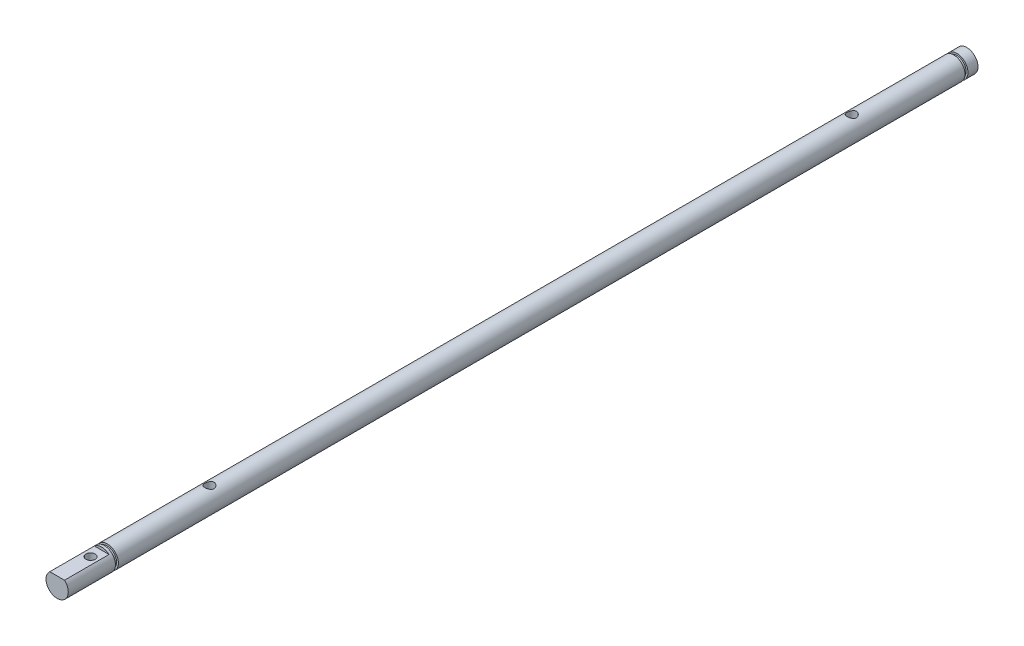
ISO-10303-21;
HEADER;
FILE_DESCRIPTION(('STEP AP214'),'2;1');
FILE_NAME('part.step','',(''),(''),'','','');
FILE_SCHEMA(('AUTOMOTIVE_DESIGN { 1 0 10303 214 1 1 1 1 }'));
ENDSEC;
DATA;
#1=APPLICATION_CONTEXT('core data for automotive mechanical design processes');
#2=APPLICATION_PROTOCOL_DEFINITION('international standard','automotive_design',2000,#1);
#3=PRODUCT_CONTEXT('',#1,'mechanical');
#4=PRODUCT('Part','Part','',(#3));
#5=PRODUCT_RELATED_PRODUCT_CATEGORY('part','',(#4));
#6=PRODUCT_DEFINITION_FORMATION('','',#4);
#7=PRODUCT_DEFINITION_CONTEXT('part definition',#1,'design');
#8=PRODUCT_DEFINITION('design','',#6,#7);
#9=PRODUCT_DEFINITION_SHAPE('','',#8);
#10=(LENGTH_UNIT() NAMED_UNIT(*) SI_UNIT(.MILLI.,.METRE.));
#11=(NAMED_UNIT(*) PLANE_ANGLE_UNIT() SI_UNIT($,.RADIAN.));
#12=(NAMED_UNIT(*) SI_UNIT($,.STERADIAN.) SOLID_ANGLE_UNIT());
#13=UNCERTAINTY_MEASURE_WITH_UNIT(LENGTH_MEASURE(1.E-05),#10,'distance_accuracy_value','');
#14=(GEOMETRIC_REPRESENTATION_CONTEXT(3) GLOBAL_UNCERTAINTY_ASSIGNED_CONTEXT((#13)) GLOBAL_UNIT_ASSIGNED_CONTEXT((#10,
#11,#12)) REPRESENTATION_CONTEXT('',''));
#15=CARTESIAN_POINT('',(0.,0.,0.));
#16=DIRECTION('',(0.,0.,1.));
#17=DIRECTION('',(1.,0.,0.));
#18=AXIS2_PLACEMENT_3D('',#15,#16,#17);
#19=CARTESIAN_POINT('',(0.,0.,245.));
#20=DIRECTION('',(0.,0.,-1.));
#21=DIRECTION('',(-1.,0.,0.));
#22=AXIS2_PLACEMENT_3D('',#19,#20,#21);
#23=CYLINDRICAL_SURFACE('',#22,3.);
#24=CARTESIAN_POINT('',(0.,0.,3.5));
#25=DIRECTION('',(0.,0.,1.));
#26=DIRECTION('',(1.,0.,0.));
#27=AXIS2_PLACEMENT_3D('',#24,#25,#26);
#28=CIRCLE('',#27,3.);
#29=CARTESIAN_POINT('',(3.,0.,3.5));
#30=VERTEX_POINT('',#29);
#31=EDGE_CURVE('E139',#30,#30,#28,.T.);
#32=ORIENTED_EDGE('',*,*,#31,.T.);
#33=EDGE_LOOP('',(#32));
#34=FACE_BOUND('',#33,.T.);
#35=CARTESIAN_POINT('',(0.,0.,231.5));
#36=DIRECTION('',(0.,0.,1.));
#37=DIRECTION('',(1.,0.,0.));
#38=AXIS2_PLACEMENT_3D('',#35,#36,#37);
#39=CIRCLE('',#38,3.);
#40=CARTESIAN_POINT('',(3.,0.,231.5));
#41=VERTEX_POINT('',#40);
#42=EDGE_CURVE('E143',#41,#41,#39,.T.);
#43=ORIENTED_EDGE('',*,*,#42,.F.);
#44=EDGE_LOOP('',(#43));
#45=FACE_BOUND('',#44,.T.);
#46=CARTESIAN_POINT('',(0.,3.,32.25));
#47=CARTESIAN_POINT('',(-0.0669580526362883,2.99999458367273,32.2499927949087));
#48=CARTESIAN_POINT('',(-0.134021397063862,2.9977323297471,32.2445880414719));
#49=CARTESIAN_POINT('',(-0.266247371156369,2.98890153579551,32.2231609350798));
#50=CARTESIAN_POINT('',(-0.331404576423586,2.98232175901027,32.2071108755357));
#51=CARTESIAN_POINT('',(-0.457688733653111,2.96556289038127,32.1650889082194));
#52=CARTESIAN_POINT('',(-0.518828524426293,2.95539599975003,32.1391506105318));
#53=CARTESIAN_POINT('',(-0.635829756679826,2.93245286470664,32.0782271767674));
#54=CARTESIAN_POINT('',(-0.691692790015962,2.91967741092849,32.0432447810291));
#55=CARTESIAN_POINT('',(-0.799448403559534,2.89207828351868,31.9633710174091));
#56=CARTESIAN_POINT('',(-0.851041267517791,2.87718753326092,31.9180986912102));
#57=CARTESIAN_POINT('',(-0.946159821091286,2.84732714068513,31.8197356652174));
#58=CARTESIAN_POINT('',(-0.989681263153109,2.83235746106809,31.7666408751055));
#59=CARTESIAN_POINT('',(-1.06953737697068,2.80321021812994,31.6509732224351));
#60=CARTESIAN_POINT('',(-1.10541308153927,2.78910786873384,31.5880625515735));
#61=CARTESIAN_POINT('',(-1.16593940588868,2.76435572357004,31.4564267420791));
#62=CARTESIAN_POINT('',(-1.19059580836293,2.75370415000822,31.3877046205155));
#63=CARTESIAN_POINT('',(-1.22674598312161,2.73778555387704,31.2498463082321));
#64=CARTESIAN_POINT('',(-1.23881657877608,2.73228387651786,31.1808895166078));
#65=CARTESIAN_POINT('',(-1.25125209967798,2.72661326219503,31.0417267073134));
#66=CARTESIAN_POINT('',(-1.25162348054399,2.72644138425259,30.9715213999743));
#67=CARTESIAN_POINT('',(-1.24108450363676,2.73125119560852,30.8375999395651));
#68=CARTESIAN_POINT('',(-1.23103681112303,2.73583882723622,30.7737989034355));
#69=CARTESIAN_POINT('',(-1.20139191015779,2.74898482773795,30.6488879089996));
#70=CARTESIAN_POINT('',(-1.18179287287179,2.75754395703563,30.5877784685082));
#71=CARTESIAN_POINT('',(-1.13321958727573,2.77786184772756,30.4684422970086));
#72=CARTESIAN_POINT('',(-1.10405471539238,2.78968481949135,30.4103045790866));
#73=CARTESIAN_POINT('',(-1.03731242580564,2.81518331141085,30.2995222661199));
#74=CARTESIAN_POINT('',(-0.999731690519565,2.82885956129779,30.2468798493865));
#75=CARTESIAN_POINT('',(-0.913495965543856,2.85792976877979,30.1439000412672));
#76=CARTESIAN_POINT('',(-0.864173483207546,2.87337121404472,30.0941334326146));
#77=CARTESIAN_POINT('',(-0.757729591051531,2.90325673112529,30.0033864970408));
#78=CARTESIAN_POINT('',(-0.700606359448476,2.91770056877009,29.9624082283078));
#79=CARTESIAN_POINT('',(-0.578447948693396,2.94438283556473,29.8895641763837));
#80=CARTESIAN_POINT('',(-0.513260582447699,2.95656266543333,29.8579305548493));
#81=CARTESIAN_POINT('',(-0.377852402526851,2.97689481414803,29.8062788603967));
#82=CARTESIAN_POINT('',(-0.307634394795056,2.985049358458,29.7862543680562));
#83=CARTESIAN_POINT('',(-0.16892811334625,2.99599641186385,29.7595840078734));
#84=CARTESIAN_POINT('',(-0.100611285278661,2.99909541047125,29.7521721425562));
#85=CARTESIAN_POINT('',(0.0363546554960679,3.00056050368745,29.7486537763859));
#86=CARTESIAN_POINT('',(0.105003667152615,2.99892795711939,29.752544029748));
#87=CARTESIAN_POINT('',(0.237098242341414,2.9913121765694,29.7709710848061));
#88=CARTESIAN_POINT('',(0.300632966639365,2.9855488728399,29.7849699540972));
#89=CARTESIAN_POINT('',(0.42438274897107,2.97048606772415,29.8224681945408));
#90=CARTESIAN_POINT('',(0.48459738651834,2.96118611959704,29.8459687659503));
#91=CARTESIAN_POINT('',(0.602108999869115,2.93958270645166,29.9025709757121));
#92=CARTESIAN_POINT('',(0.659257236855303,2.92719491469282,29.935948183146));
#93=CARTESIAN_POINT('',(0.767346216231408,2.90073804579091,30.0110533777917));
#94=CARTESIAN_POINT('',(0.81828435260192,2.88666826768734,30.0527848515293));
#95=CARTESIAN_POINT('',(0.916333430274243,2.85712087895438,30.1469032332724));
#96=CARTESIAN_POINT('',(0.962910697979814,2.8416145159103,30.1998385029863));
#97=CARTESIAN_POINT('',(1.04666984610549,2.81184336768006,30.3130212759354));
#98=CARTESIAN_POINT('',(1.08384959285615,2.79757886493439,30.3732704351717));
#99=CARTESIAN_POINT('',(1.14815960208697,2.77181386243989,30.5006141753026));
#100=CARTESIAN_POINT('',(1.17513918237327,2.76035562555112,30.5677940355148));
#101=CARTESIAN_POINT('',(1.21717413951571,2.74208355658958,30.7063705938101));
#102=CARTESIAN_POINT('',(1.23223934863685,2.73526589555753,30.7777637624833));
#103=CARTESIAN_POINT('',(1.24904080348898,2.72763164537265,30.9168186991992));
#104=CARTESIAN_POINT('',(1.25171380413127,2.72639350967164,30.9843446622926));
#105=CARTESIAN_POINT('',(1.2461557552391,2.72893853011025,31.1188428611411));
#106=CARTESIAN_POINT('',(1.23792637964719,2.73272091540308,31.1858151803137));
#107=CARTESIAN_POINT('',(1.21158404780489,2.74449551302269,31.3140927474689));
#108=CARTESIAN_POINT('',(1.19394903571464,2.75228354846481,31.3755166734634));
#109=CARTESIAN_POINT('',(1.14976328202132,2.7710318119919,31.4945480213572));
#110=CARTESIAN_POINT('',(1.1232100351725,2.78199293131694,31.5521543653988));
#111=CARTESIAN_POINT('',(1.06010285935487,2.80666954560014,31.6656958959491));
#112=CARTESIAN_POINT('',(1.02304360910481,2.8205110271368,31.7213223301683));
#113=CARTESIAN_POINT('',(0.940684072630365,2.8490368905384,31.8258601393607));
#114=CARTESIAN_POINT('',(0.895380928905595,2.86372156345876,31.8747691756006));
#115=CARTESIAN_POINT('',(0.793902045778798,2.89356392850107,31.9681486816847));
#116=CARTESIAN_POINT('',(0.737174739949005,2.90867817511792,32.0120364328407));
#117=CARTESIAN_POINT('',(0.616600079253178,2.9366014362202,32.0896994535436));
#118=CARTESIAN_POINT('',(0.552749497945725,2.94940939916741,32.1234701148895));
#119=CARTESIAN_POINT('',(0.420732056717931,2.97109183362461,32.1792098454399));
#120=CARTESIAN_POINT('',(0.352653990980616,2.98002782581964,32.2013647666173));
#121=CARTESIAN_POINT('',(0.213410421846538,2.99321009768625,32.2337063290778));
#122=CARTESIAN_POINT('',(0.142255316980936,2.99747105811967,32.2439304425299));
#123=CARTESIAN_POINT('',(0.0472360819191612,2.99972287568934,32.2493331610864));
#124=CARTESIAN_POINT('',(0.0236245946756354,3.00000191102536,32.2500025421492));
#125=CARTESIAN_POINT('',(0.,3.,32.25));
#126=B_SPLINE_CURVE_WITH_KNOTS('',3,(#46,#47,#48,#49,#50,#51,#52,#53,#54,#55,#56,#57,#58,#59,
#60,#61,#62,#63,#64,#65,#66,#67,#68,#69,#70,#71,#72,#73,#74,#75,#76,#77,#78,#79,#80,#81,#82,#83,
#84,#85,#86,#87,#88,#89,#90,#91,#92,#93,#94,#95,#96,#97,#98,#99,#100,#101,#102,#103,#104,#105,
#106,#107,#108,#109,#110,#111,#112,#113,#114,#115,#116,#117,#118,#119,#120,#121,#122,#123,#124,
#125),.UNSPECIFIED.,.T.,.F.,(4,2,2,2,2,2,2,2,2,2,2,2,2,2,2,2,2,2,2,2,2,2,2,2,2,2,2,2,2,2,2,2,2,
2,2,2,2,2,2,4),(0.,0.20080691888394,0.402138540628697,0.602791851906305,0.803384436852976,
1.01317936288807,1.22308438131466,1.44331724539126,1.66343646730589,1.87295273137558,
2.08235338249047,2.27570157202556,2.46908679727213,2.66658713058715,2.86416545717207,
3.07844141127897,3.29276749314588,3.51204055060814,3.73119224218297,3.93648443393251,
4.14171767493172,4.33676589735721,4.53183876601785,4.73297135272161,4.93418805469496,
5.14978488029294,5.36543061240341,5.58414788359523,5.8026844707458,6.00439877559644,
6.20608211297537,6.39837649964762,6.59072494950613,6.79463893397442,6.99862373425945,
7.21746535004889,7.43640649428582,7.65172855819385,7.86637250469321,7.93722256499098),.UNSPECIFIED.);
#127=CARTESIAN_POINT('',(0.,3.,32.25));
#128=VERTEX_POINT('',#127);
#129=EDGE_CURVE('E95',#128,#128,#126,.T.);
#130=ORIENTED_EDGE('',*,*,#129,.T.);
#131=EDGE_LOOP('',(#130));
#132=FACE_BOUND('',#131,.T.);
#133=CARTESIAN_POINT('',(0.,-3.,32.25));
#134=CARTESIAN_POINT('',(0.0669580526362457,-2.99999458367273,32.2499927949087));
#135=CARTESIAN_POINT('',(0.13402139706382,-2.9977323297471,32.2445880414719));
#136=CARTESIAN_POINT('',(0.266247371156325,-2.98890153579552,32.2231609350798));
#137=CARTESIAN_POINT('',(0.331404576423543,-2.98232175901028,32.2071108755357));
#138=CARTESIAN_POINT('',(0.457688733653068,-2.96556289038128,32.1650889082194));
#139=CARTESIAN_POINT('',(0.51882852442625,-2.95539599975004,32.1391506105318));
#140=CARTESIAN_POINT('',(0.635829756679783,-2.93245286470664,32.0782271767674));
#141=CARTESIAN_POINT('',(0.691692790015919,-2.9196774109285,32.0432447810291));
#142=CARTESIAN_POINT('',(0.799448403559491,-2.89207828351869,31.9633710174091));
#143=CARTESIAN_POINT('',(0.851041267517749,-2.87718753326093,31.9180986912102));
#144=CARTESIAN_POINT('',(0.946159821091243,-2.84732714068514,31.8197356652174));
#145=CARTESIAN_POINT('',(0.989681263153066,-2.8323574610681,31.7666408751055));
#146=CARTESIAN_POINT('',(1.06953737697064,-2.80321021812996,31.6509732224351));
#147=CARTESIAN_POINT('',(1.10541308153923,-2.78910786873385,31.5880625515735));
#148=CARTESIAN_POINT('',(1.16593940588864,-2.76435572357006,31.4564267420791));
#149=CARTESIAN_POINT('',(1.19059580836289,-2.75370415000824,31.3877046205155));
#150=CARTESIAN_POINT('',(1.22674598312157,-2.73778555387706,31.2498463082321));
#151=CARTESIAN_POINT('',(1.23881657877603,-2.73228387651788,31.1808895166078));
#152=CARTESIAN_POINT('',(1.25125209967794,-2.72661326219505,31.0417267073134));
#153=CARTESIAN_POINT('',(1.25162348054395,-2.72644138425261,30.9715213999743));
#154=CARTESIAN_POINT('',(1.24108450363672,-2.73125119560854,30.8375999395651));
#155=CARTESIAN_POINT('',(1.23103681112299,-2.73583882723624,30.7737989034355));
#156=CARTESIAN_POINT('',(1.20139191015774,-2.74898482773797,30.6488879089996));
#157=CARTESIAN_POINT('',(1.18179287287175,-2.75754395703565,30.5877784685082));
#158=CARTESIAN_POINT('',(1.13321958727569,-2.77786184772757,30.4684422970086));
#159=CARTESIAN_POINT('',(1.10405471539234,-2.78968481949137,30.4103045790866));
#160=CARTESIAN_POINT('',(1.0373124258056,-2.81518331141087,30.2995222661199));
#161=CARTESIAN_POINT('',(0.999731690519522,-2.8288595612978,30.2468798493865));
#162=CARTESIAN_POINT('',(0.913495965543812,-2.8579297687798,30.1439000412672));
#163=CARTESIAN_POINT('',(0.864173483207502,-2.87337121404473,30.0941334326146));
#164=CARTESIAN_POINT('',(0.757729591051488,-2.9032567311253,30.0033864970408));
#165=CARTESIAN_POINT('',(0.700606359448433,-2.9177005687701,29.9624082283078));
#166=CARTESIAN_POINT('',(0.578447948693354,-2.94438283556473,29.8895641763837));
#167=CARTESIAN_POINT('',(0.513260582447658,-2.95656266543334,29.8579305548493));
#168=CARTESIAN_POINT('',(0.37785240252681,-2.97689481414804,29.8062788603967));
#169=CARTESIAN_POINT('',(0.307634394795014,-2.985049358458,29.7862543680562));
#170=CARTESIAN_POINT('',(0.168928113346207,-2.99599641186385,29.7595840078734));
#171=CARTESIAN_POINT('',(0.100611285278619,-2.99909541047125,29.7521721425562));
#172=CARTESIAN_POINT('',(-0.0363546554961092,-3.00056050368745,29.7486537763859));
#173=CARTESIAN_POINT('',(-0.105003667152656,-2.99892795711939,29.752544029748));
#174=CARTESIAN_POINT('',(-0.237098242341456,-2.9913121765694,29.7709710848061));
#175=CARTESIAN_POINT('',(-0.300632966639408,-2.98554887283989,29.7849699540972));
#176=CARTESIAN_POINT('',(-0.424382748971112,-2.97048606772414,29.8224681945408));
#177=CARTESIAN_POINT('',(-0.484597386518382,-2.96118611959703,29.8459687659503));
#178=CARTESIAN_POINT('',(-0.602108999869157,-2.93958270645165,29.9025709757121));
#179=CARTESIAN_POINT('',(-0.659257236855344,-2.92719491469281,29.935948183146));
#180=CARTESIAN_POINT('',(-0.76734621623145,-2.9007380457909,30.0110533777917));
#181=CARTESIAN_POINT('',(-0.818284352601962,-2.88666826768732,30.0527848515293));
#182=CARTESIAN_POINT('',(-0.916333430274285,-2.85712087895437,30.1469032332724));
#183=CARTESIAN_POINT('',(-0.962910697979856,-2.84161451591028,30.1998385029863));
#184=CARTESIAN_POINT('',(-1.04666984610553,-2.81184336768004,30.3130212759354));
#185=CARTESIAN_POINT('',(-1.0838495928562,-2.79757886493438,30.3732704351717));
#186=CARTESIAN_POINT('',(-1.14815960208701,-2.77181386243987,30.5006141753026));
#187=CARTESIAN_POINT('',(-1.17513918237331,-2.76035562555111,30.5677940355148));
#188=CARTESIAN_POINT('',(-1.21717413951575,-2.74208355658956,30.7063705938101));
#189=CARTESIAN_POINT('',(-1.2322393486369,-2.73526589555751,30.7777637624833));
#190=CARTESIAN_POINT('',(-1.24904080348903,-2.72763164537263,30.9168186991992));
#191=CARTESIAN_POINT('',(-1.25171380413131,-2.72639350967162,30.9843446622926));
#192=CARTESIAN_POINT('',(-1.24615575523914,-2.72893853011023,31.1188428611411));
#193=CARTESIAN_POINT('',(-1.23792637964724,-2.73272091540305,31.1858151803137));
#194=CARTESIAN_POINT('',(-1.21158404780493,-2.74449551302267,31.3140927474689));
#195=CARTESIAN_POINT('',(-1.19394903571468,-2.7522835484648,31.3755166734634));
#196=CARTESIAN_POINT('',(-1.14976328202137,-2.77103181199188,31.4945480213572));
#197=CARTESIAN_POINT('',(-1.12321003517254,-2.78199293131692,31.5521543653988));
#198=CARTESIAN_POINT('',(-1.06010285935492,-2.80666954560012,31.6656958959491));
#199=CARTESIAN_POINT('',(-1.02304360910486,-2.82051102713679,31.7213223301683));
#200=CARTESIAN_POINT('',(-0.940684072630414,-2.84903689053839,31.8258601393607));
#201=CARTESIAN_POINT('',(-0.895380928905643,-2.86372156345874,31.8747691756006));
#202=CARTESIAN_POINT('',(-0.793902045778846,-2.89356392850106,31.9681486816847));
#203=CARTESIAN_POINT('',(-0.737174739949054,-2.90867817511791,32.0120364328407));
#204=CARTESIAN_POINT('',(-0.616600079253225,-2.93660143622019,32.0896994535436));
#205=CARTESIAN_POINT('',(-0.552749497945771,-2.9494093991674,32.1234701148895));
#206=CARTESIAN_POINT('',(-0.420732056717974,-2.9710918336246,32.1792098454399));
#207=CARTESIAN_POINT('',(-0.352653990980659,-2.98002782581964,32.2013647666173));
#208=CARTESIAN_POINT('',(-0.213410421846581,-2.99321009768624,32.2337063290778));
#209=CARTESIAN_POINT('',(-0.14225531698098,-2.99747105811967,32.2439304425299));
#210=CARTESIAN_POINT('',(-0.0472360819192053,-2.99972287568934,32.2493331610864));
#211=CARTESIAN_POINT('',(-0.0236245946756787,-3.00000191102536,32.2500025421492));
#212=CARTESIAN_POINT('',(0.,-3.,32.25));
#213=B_SPLINE_CURVE_WITH_KNOTS('',3,(#133,#134,#135,#136,#137,#138,#139,#140,#141,#142,#143,
#144,#145,#146,#147,#148,#149,#150,#151,#152,#153,#154,#155,#156,#157,#158,#159,#160,#161,#162,
#163,#164,#165,#166,#167,#168,#169,#170,#171,#172,#173,#174,#175,#176,#177,#178,#179,#180,#181,
#182,#183,#184,#185,#186,#187,#188,#189,#190,#191,#192,#193,#194,#195,#196,#197,#198,#199,#200,
#201,#202,#203,#204,#205,#206,#207,#208,#209,#210,#211,#212),.UNSPECIFIED.,.T.,.F.,(4,2,2,2,2,2,
2,2,2,2,2,2,2,2,2,2,2,2,2,2,2,2,2,2,2,2,2,2,2,2,2,2,2,2,2,2,2,2,2,4),(0.,0.200806918883939,
0.402138540628696,0.602791851906304,0.803384436852975,1.01317936288807,1.22308438131465,
1.44331724539126,1.66343646730588,1.87295273137558,2.08235338249046,2.27570157202556,
2.46908679727212,2.66658713058714,2.86416545717207,3.07844141127897,3.29276749314588,
3.51204055060813,3.73119224218297,3.93648443393251,4.14171767493171,4.33676589735721,
4.53183876601785,4.73297135272161,4.93418805469496,5.14978488029294,5.36543061240341,
5.58414788359523,5.8026844707458,6.00439877559644,6.20608211297536,6.39837649964762,
6.59072494950612,6.79463893397441,6.99862373425944,7.21746535004889,7.43640649428582,
7.65172855819385,7.86637250469321,7.93722256499098),.UNSPECIFIED.);
#214=CARTESIAN_POINT('',(0.,-3.,32.25));
#215=VERTEX_POINT('',#214);
#216=EDGE_CURVE('E50',#215,#215,#213,.T.);
#217=ORIENTED_EDGE('',*,*,#216,.T.);
#218=EDGE_LOOP('',(#217));
#219=FACE_BOUND('',#218,.T.);
#220=CARTESIAN_POINT('',(0.,3.,205.25));
#221=CARTESIAN_POINT('',(-0.066958052636265,2.99999458367273,205.249992794909));
#222=CARTESIAN_POINT('',(-0.134021397063838,2.9977323297471,205.244588041472));
#223=CARTESIAN_POINT('',(-0.266247371156344,2.98890153579552,205.22316093508));
#224=CARTESIAN_POINT('',(-0.331404576423563,2.98232175901028,205.207110875536));
#225=CARTESIAN_POINT('',(-0.457688733653085,2.96556289038127,205.165088908219));
#226=CARTESIAN_POINT('',(-0.518828524426264,2.95539599975004,205.139150610532));
#227=CARTESIAN_POINT('',(-0.635829756679796,2.93245286470664,205.078227176767));
#228=CARTESIAN_POINT('',(-0.691692790015934,2.91967741092849,205.043244781029));
#229=CARTESIAN_POINT('',(-0.799448403559516,2.89207828351869,204.963371017409));
#230=CARTESIAN_POINT('',(-0.851041267517781,2.87718753326093,204.91809869121));
#231=CARTESIAN_POINT('',(-0.946159821091273,2.84732714068513,204.819735665217));
#232=CARTESIAN_POINT('',(-0.98968126315309,2.83235746106809,204.766640875105));
#233=CARTESIAN_POINT('',(-1.06953737697065,2.80321021812995,204.650973222435));
#234=CARTESIAN_POINT('',(-1.10541308153924,2.78910786873385,204.588062551573));
#235=CARTESIAN_POINT('',(-1.16593940588865,2.76435572357005,204.456426742079));
#236=CARTESIAN_POINT('',(-1.1905958083629,2.75370415000824,204.387704620516));
#237=CARTESIAN_POINT('',(-1.22674598312158,2.73778555387705,204.249846308232));
#238=CARTESIAN_POINT('',(-1.23881657877605,2.73228387651787,204.180889516608));
#239=CARTESIAN_POINT('',(-1.25125209967796,2.72661326219504,204.041726707313));
#240=CARTESIAN_POINT('',(-1.25162348054397,2.7264413842526,203.971521399974));
#241=CARTESIAN_POINT('',(-1.24108450363674,2.73125119560853,203.837599939565));
#242=CARTESIAN_POINT('',(-1.231036811123,2.73583882723623,203.773798903436));
#243=CARTESIAN_POINT('',(-1.20139191015777,2.74898482773796,203.648887909));
#244=CARTESIAN_POINT('',(-1.18179287287177,2.75754395703564,203.587778468508));
#245=CARTESIAN_POINT('',(-1.13321958727571,2.77786184772756,203.468442297009));
#246=CARTESIAN_POINT('',(-1.10405471539236,2.78968481949136,203.410304579087));
#247=CARTESIAN_POINT('',(-1.03731242580562,2.81518331141086,203.29952226612));
#248=CARTESIAN_POINT('',(-0.999731690519538,2.8288595612978,203.246879849386));
#249=CARTESIAN_POINT('',(-0.913495965543822,2.8579297687798,203.143900041267));
#250=CARTESIAN_POINT('',(-0.864173483207506,2.87337121404473,203.094133432615));
#251=CARTESIAN_POINT('',(-0.757729591051491,2.9032567311253,203.003386497041));
#252=CARTESIAN_POINT('',(-0.700606359448443,2.9177005687701,202.962408228308));
#253=CARTESIAN_POINT('',(-0.578447948693369,2.94438283556473,202.889564176384));
#254=CARTESIAN_POINT('',(-0.513260582447671,2.95656266543334,202.857930554849));
#255=CARTESIAN_POINT('',(-0.377852402526826,2.97689481414803,202.806278860397));
#256=CARTESIAN_POINT('',(-0.307634394795035,2.985049358458,202.786254368056));
#257=CARTESIAN_POINT('',(-0.168928113346232,2.99599641186385,202.759584007873));
#258=CARTESIAN_POINT('',(-0.100611285278641,2.99909541047125,202.752172142556));
#259=CARTESIAN_POINT('',(0.0363546554960918,3.00056050368745,202.748653776386));
#260=CARTESIAN_POINT('',(0.105003667152641,2.99892795711939,202.752544029748));
#261=CARTESIAN_POINT('',(0.237098242341439,2.9913121765694,202.770971084806));
#262=CARTESIAN_POINT('',(0.300632966639386,2.9855488728399,202.784969954097));
#263=CARTESIAN_POINT('',(0.424382748971091,2.97048606772414,202.822468194541));
#264=CARTESIAN_POINT('',(0.484597386518367,2.96118611959704,202.84596876595));
#265=CARTESIAN_POINT('',(0.602108999869144,2.93958270645166,202.902570975712));
#266=CARTESIAN_POINT('',(0.659257236855329,2.92719491469281,202.935948183146));
#267=CARTESIAN_POINT('',(0.767346216231434,2.9007380457909,203.011053377792));
#268=CARTESIAN_POINT('',(0.818284352601949,2.88666826768733,203.052784851529));
#269=CARTESIAN_POINT('',(0.916333430274273,2.85712087895437,203.146903233272));
#270=CARTESIAN_POINT('',(0.962910697979843,2.84161451591029,203.199838502986));
#271=CARTESIAN_POINT('',(1.04666984610551,2.81184336768005,203.313021275935));
#272=CARTESIAN_POINT('',(1.08384959285618,2.79757886493438,203.373270435172));
#273=CARTESIAN_POINT('',(1.14815960208699,2.77181386243988,203.500614175303));
#274=CARTESIAN_POINT('',(1.17513918237329,2.76035562555112,203.567794035515));
#275=CARTESIAN_POINT('',(1.21717413951573,2.74208355658957,203.70637059381));
#276=CARTESIAN_POINT('',(1.23223934863687,2.73526589555752,203.777763762483));
#277=CARTESIAN_POINT('',(1.24904080348901,2.72763164537264,203.916818699199));
#278=CARTESIAN_POINT('',(1.25171380413129,2.72639350967163,203.984344662293));
#279=CARTESIAN_POINT('',(1.24615575523913,2.72893853011024,204.118842861141));
#280=CARTESIAN_POINT('',(1.23792637964722,2.73272091540306,204.185815180314));
#281=CARTESIAN_POINT('',(1.21158404780492,2.74449551302268,204.314092747469));
#282=CARTESIAN_POINT('',(1.19394903571467,2.7522835484648,204.375516673463));
#283=CARTESIAN_POINT('',(1.14976328202136,2.77103181199189,204.494548021357));
#284=CARTESIAN_POINT('',(1.12321003517252,2.78199293131693,204.552154365399));
#285=CARTESIAN_POINT('',(1.0601028593549,2.80666954560013,204.665695895949));
#286=CARTESIAN_POINT('',(1.02304360910484,2.82051102713679,204.721322330168));
#287=CARTESIAN_POINT('',(0.940684072630405,2.84903689053839,204.825860139361));
#288=CARTESIAN_POINT('',(0.895380928905635,2.86372156345874,204.874769175601));
#289=CARTESIAN_POINT('',(0.793902045778838,2.89356392850106,204.968148681685));
#290=CARTESIAN_POINT('',(0.737174739949042,2.90867817511791,205.012036432841));
#291=CARTESIAN_POINT('',(0.616600079253205,2.9366014362202,205.089699453544));
#292=CARTESIAN_POINT('',(0.552749497945745,2.9494093991674,205.12347011489));
#293=CARTESIAN_POINT('',(0.420732056717944,2.97109183362461,205.17920984544));
#294=CARTESIAN_POINT('',(0.352653990980631,2.98002782581964,205.201364766617));
#295=CARTESIAN_POINT('',(0.213410421846558,2.99321009768625,205.233706329078));
#296=CARTESIAN_POINT('',(0.14225531698096,2.99747105811967,205.24393044253));
#297=CARTESIAN_POINT('',(0.0472360819191863,2.99972287568934,205.249333161086));
#298=CARTESIAN_POINT('',(0.0236245946756592,3.00000191102536,205.250002542149));
#299=CARTESIAN_POINT('',(0.,3.,205.25));
#300=B_SPLINE_CURVE_WITH_KNOTS('',3,(#220,#221,#222,#223,#224,#225,#226,#227,#228,#229,#230,
#231,#232,#233,#234,#235,#236,#237,#238,#239,#240,#241,#242,#243,#244,#245,#246,#247,#248,#249,
#250,#251,#252,#253,#254,#255,#256,#257,#258,#259,#260,#261,#262,#263,#264,#265,#266,#267,#268,
#269,#270,#271,#272,#273,#274,#275,#276,#277,#278,#279,#280,#281,#282,#283,#284,#285,#286,#287,
#288,#289,#290,#291,#292,#293,#294,#295,#296,#297,#298,#299),.UNSPECIFIED.,.T.,.F.,(4,2,2,2,2,2,
2,2,2,2,2,2,2,2,2,2,2,2,2,2,2,2,2,2,2,2,2,2,2,2,2,2,2,2,2,2,2,2,2,4),(0.,0.200806918883936,
0.402138540628698,0.602791851906299,0.803384436852969,1.0131793628881,1.22308438131465,
1.44331724539122,1.66343646730588,1.87295273137558,2.08235338249047,2.27570157202556,
2.46908679727211,2.66658713058713,2.86416545717207,3.07844141127898,3.29276749314589,
3.51204055060814,3.73119224218296,3.93648443393251,4.14171767493172,4.33676589735721,
4.53183876601785,4.73297135272161,4.93418805469496,5.14978488029296,5.36543061240342,
5.58414788359521,5.80268447074579,6.00439877559641,6.20608211297534,6.3983764996476,
6.59072494950611,6.79463893397441,6.9986237342594,7.21746535004887,7.43640649428582,
7.65172855819385,7.8663725046932,7.93722256499097),.UNSPECIFIED.);
#301=CARTESIAN_POINT('',(0.,3.,205.25));
#302=VERTEX_POINT('',#301);
#303=EDGE_CURVE('E153',#302,#302,#300,.T.);
#304=ORIENTED_EDGE('',*,*,#303,.T.);
#305=EDGE_LOOP('',(#304));
#306=FACE_BOUND('',#305,.T.);
#307=CARTESIAN_POINT('',(0.,-3.,205.25));
#308=CARTESIAN_POINT('',(0.0669580526362676,-2.99999458367273,205.249992794909));
#309=CARTESIAN_POINT('',(0.134021397063841,-2.9977323297471,205.244588041472));
#310=CARTESIAN_POINT('',(0.266247371156347,-2.98890153579552,205.22316093508));
#311=CARTESIAN_POINT('',(0.331404576423565,-2.98232175901028,205.207110875536));
#312=CARTESIAN_POINT('',(0.457688733653087,-2.96556289038127,205.165088908219));
#313=CARTESIAN_POINT('',(0.518828524426266,-2.95539599975004,205.139150610532));
#314=CARTESIAN_POINT('',(0.635829756679799,-2.93245286470664,205.078227176767));
#315=CARTESIAN_POINT('',(0.691692790015937,-2.91967741092849,205.043244781029));
#316=CARTESIAN_POINT('',(0.799448403559509,-2.89207828351869,204.963371017409));
#317=CARTESIAN_POINT('',(0.851041267517764,-2.87718753326093,204.91809869121));
#318=CARTESIAN_POINT('',(0.946159821091259,-2.84732714068514,204.819735665217));
#319=CARTESIAN_POINT('',(0.989681263153085,-2.83235746106809,204.766640875105));
#320=CARTESIAN_POINT('',(1.06953737697065,-2.80321021812995,204.650973222435));
#321=CARTESIAN_POINT('',(1.10541308153925,-2.78910786873385,204.588062551573));
#322=CARTESIAN_POINT('',(1.16593940588865,-2.76435572357005,204.456426742079));
#323=CARTESIAN_POINT('',(1.19059580836291,-2.75370415000824,204.387704620516));
#324=CARTESIAN_POINT('',(1.22674598312159,-2.73778555387705,204.249846308232));
#325=CARTESIAN_POINT('',(1.23881657877606,-2.73228387651787,204.180889516608));
#326=CARTESIAN_POINT('',(1.25125209967797,-2.72661326219504,204.041726707313));
#327=CARTESIAN_POINT('',(1.25162348054397,-2.7264413842526,203.971521399974));
#328=CARTESIAN_POINT('',(1.24108450363674,-2.73125119560853,203.837599939565));
#329=CARTESIAN_POINT('',(1.23103681112301,-2.73583882723623,203.773798903436));
#330=CARTESIAN_POINT('',(1.20139191015777,-2.74898482773796,203.648887909));
#331=CARTESIAN_POINT('',(1.18179287287177,-2.75754395703563,203.587778468508));
#332=CARTESIAN_POINT('',(1.13321958727571,-2.77786184772756,203.468442297009));
#333=CARTESIAN_POINT('',(1.10405471539236,-2.78968481949136,203.410304579087));
#334=CARTESIAN_POINT('',(1.03731242580562,-2.81518331141086,203.29952226612));
#335=CARTESIAN_POINT('',(0.99973169051954,-2.8288595612978,203.246879849386));
#336=CARTESIAN_POINT('',(0.913495965543825,-2.8579297687798,203.143900041267));
#337=CARTESIAN_POINT('',(0.864173483207508,-2.87337121404473,203.094133432615));
#338=CARTESIAN_POINT('',(0.757729591051494,-2.9032567311253,203.003386497041));
#339=CARTESIAN_POINT('',(0.700606359448446,-2.9177005687701,202.962408228308));
#340=CARTESIAN_POINT('',(0.578447948693369,-2.94438283556473,202.889564176384));
#341=CARTESIAN_POINT('',(0.513260582447667,-2.95656266543334,202.857930554849));
#342=CARTESIAN_POINT('',(0.377852402526822,-2.97689481414803,202.806278860397));
#343=CARTESIAN_POINT('',(0.307634394795035,-2.985049358458,202.786254368056));
#344=CARTESIAN_POINT('',(0.168928113346236,-2.99599641186385,202.759584007873));
#345=CARTESIAN_POINT('',(0.100611285278644,-2.99909541047125,202.752172142556));
#346=CARTESIAN_POINT('',(-0.0363546554960889,-3.00056050368745,202.748653776386));
#347=CARTESIAN_POINT('',(-0.105003667152638,-2.99892795711939,202.752544029748));
#348=CARTESIAN_POINT('',(-0.237098242341435,-2.9913121765694,202.770971084806));
#349=CARTESIAN_POINT('',(-0.300632966639382,-2.9855488728399,202.784969954097));
#350=CARTESIAN_POINT('',(-0.424382748971086,-2.97048606772414,202.822468194541));
#351=CARTESIAN_POINT('',(-0.484597386518361,-2.96118611959704,202.84596876595));
#352=CARTESIAN_POINT('',(-0.602108999869139,-2.93958270645166,202.902570975712));
#353=CARTESIAN_POINT('',(-0.659257236855324,-2.92719491469281,202.935948183146));
#354=CARTESIAN_POINT('',(-0.76734621623143,-2.9007380457909,203.011053377792));
#355=CARTESIAN_POINT('',(-0.818284352601945,-2.88666826768733,203.052784851529));
#356=CARTESIAN_POINT('',(-0.91633343027427,-2.85712087895437,203.146903233272));
#357=CARTESIAN_POINT('',(-0.96291069797984,-2.84161451591029,203.199838502986));
#358=CARTESIAN_POINT('',(-1.04666984610551,-2.81184336768005,203.313021275935));
#359=CARTESIAN_POINT('',(-1.08384959285618,-2.79757886493438,203.373270435172));
#360=CARTESIAN_POINT('',(-1.14815960208699,-2.77181386243988,203.500614175303));
#361=CARTESIAN_POINT('',(-1.17513918237328,-2.76035562555112,203.567794035515));
#362=CARTESIAN_POINT('',(-1.21717413951572,-2.74208355658957,203.70637059381));
#363=CARTESIAN_POINT('',(-1.23223934863687,-2.73526589555752,203.777763762483));
#364=CARTESIAN_POINT('',(-1.249040803489,-2.72763164537264,203.916818699199));
#365=CARTESIAN_POINT('',(-1.25171380413129,-2.72639350967163,203.984344662293));
#366=CARTESIAN_POINT('',(-1.24615575523912,-2.72893853011024,204.118842861141));
#367=CARTESIAN_POINT('',(-1.23792637964721,-2.73272091540306,204.185815180314));
#368=CARTESIAN_POINT('',(-1.21158404780491,-2.74449551302268,204.314092747469));
#369=CARTESIAN_POINT('',(-1.19394903571467,-2.7522835484648,204.375516673463));
#370=CARTESIAN_POINT('',(-1.14976328202135,-2.77103181199189,204.494548021357));
#371=CARTESIAN_POINT('',(-1.12321003517252,-2.78199293131693,204.552154365399));
#372=CARTESIAN_POINT('',(-1.0601028593549,-2.80666954560013,204.665695895949));
#373=CARTESIAN_POINT('',(-1.02304360910484,-2.82051102713679,204.721322330168));
#374=CARTESIAN_POINT('',(-0.940684072630402,-2.84903689053839,204.825860139361));
#375=CARTESIAN_POINT('',(-0.895380928905632,-2.86372156345874,204.874769175601));
#376=CARTESIAN_POINT('',(-0.793902045778835,-2.89356392850106,204.968148681685));
#377=CARTESIAN_POINT('',(-0.73717473994904,-2.90867817511791,205.012036432841));
#378=CARTESIAN_POINT('',(-0.616600079253202,-2.9366014362202,205.089699453544));
#379=CARTESIAN_POINT('',(-0.552749497945743,-2.94940939916741,205.12347011489));
#380=CARTESIAN_POINT('',(-0.420732056717942,-2.97109183362461,205.17920984544));
#381=CARTESIAN_POINT('',(-0.352653990980628,-2.98002782581964,205.201364766617));
#382=CARTESIAN_POINT('',(-0.213410421846556,-2.99321009768625,205.233706329078));
#383=CARTESIAN_POINT('',(-0.142255316980958,-2.99747105811967,205.24393044253));
#384=CARTESIAN_POINT('',(-0.0472360819191842,-2.99972287568934,205.249333161086));
#385=CARTESIAN_POINT('',(-0.0236245946756569,-3.00000191102536,205.250002542149));
#386=CARTESIAN_POINT('',(0.,-3.,205.25));
#387=B_SPLINE_CURVE_WITH_KNOTS('',3,(#307,#308,#309,#310,#311,#312,#313,#314,#315,#316,#317,
#318,#319,#320,#321,#322,#323,#324,#325,#326,#327,#328,#329,#330,#331,#332,#333,#334,#335,#336,
#337,#338,#339,#340,#341,#342,#343,#344,#345,#346,#347,#348,#349,#350,#351,#352,#353,#354,#355,
#356,#357,#358,#359,#360,#361,#362,#363,#364,#365,#366,#367,#368,#369,#370,#371,#372,#373,#374,
#375,#376,#377,#378,#379,#380,#381,#382,#383,#384,#385,#386),.UNSPECIFIED.,.T.,.F.,(4,2,2,2,2,2,
2,2,2,2,2,2,2,2,2,2,2,2,2,2,2,2,2,2,2,2,2,2,2,2,2,2,2,2,2,2,2,2,2,4),(0.,0.200806918883936,
0.402138540628699,0.602791851906299,0.803384436852969,1.01317936288806,1.22308438131465,
1.44331724539122,1.66343646730588,1.87295273137558,2.08235338249047,2.27570157202556,
2.46908679727211,2.66658713058713,2.86416545717207,3.07844141127898,3.29276749314589,
3.51204055060814,3.73119224218296,3.9364844339325,4.14171767493172,4.33676589735721,
4.53183876601784,4.73297135272161,4.93418805469496,5.14978488029296,5.36543061240342,
5.5841478835952,5.80268447074579,6.0043987755964,6.20608211297534,6.3983764996476,
6.59072494950611,6.7946389339744,6.9986237342594,7.21746535004887,7.43640649428582,
7.65172855819384,7.8663725046932,7.93722256499097),.UNSPECIFIED.);
#388=CARTESIAN_POINT('',(0.,-3.,205.25));
#389=VERTEX_POINT('',#388);
#390=EDGE_CURVE('E11',#389,#389,#387,.T.);
#391=ORIENTED_EDGE('',*,*,#390,.T.);
#392=EDGE_LOOP('',(#391));
#393=FACE_BOUND('',#392,.T.);
#394=ADVANCED_FACE('F37',(#34,#45,#132,#219,#306,#393),#23,.T.);
#395=CARTESIAN_POINT('',(0.,0.,245.));
#396=DIRECTION('',(0.,0.,1.));
#397=DIRECTION('',(1.,0.,0.));
#398=AXIS2_PLACEMENT_3D('',#395,#396,#397);
#399=CIRCLE('',#398,3.);
#400=CARTESIAN_POINT('',(-1.98431348329844,2.25,245.));
#401=VERTEX_POINT('',#400);
#402=CARTESIAN_POINT('',(1.98431348329844,2.25,245.));
#403=VERTEX_POINT('',#402);
#404=EDGE_CURVE('E79',#401,#403,#399,.T.);
#405=ORIENTED_EDGE('',*,*,#404,.F.);
#406=DIRECTION('',(0.,0.,1.));
#407=VECTOR('',#406,1.);
#408=CARTESIAN_POINT('',(-1.98431348329844,2.25,233.));
#409=LINE('',#408,#407);
#410=CARTESIAN_POINT('',(-1.98431348329844,2.25,233.));
#411=VERTEX_POINT('',#410);
#412=EDGE_CURVE('E57',#411,#401,#409,.T.);
#413=ORIENTED_EDGE('',*,*,#412,.F.);
#414=CARTESIAN_POINT('',(0.,0.,233.));
#415=DIRECTION('',(0.,0.,1.));
#416=DIRECTION('',(1.,0.,0.));
#417=AXIS2_PLACEMENT_3D('',#414,#415,#416);
#418=CIRCLE('',#417,3.);
#419=CARTESIAN_POINT('',(1.98431348329844,2.25,233.));
#420=VERTEX_POINT('',#419);
#421=EDGE_CURVE('E73',#420,#411,#418,.T.);
#422=ORIENTED_EDGE('',*,*,#421,.F.);
#423=DIRECTION('',(0.,0.,1.));
#424=VECTOR('',#423,1.);
#425=CARTESIAN_POINT('',(1.98431348329844,2.25,233.));
#426=LINE('',#425,#424);
#427=EDGE_CURVE('E63',#420,#403,#426,.T.);
#428=ORIENTED_EDGE('',*,*,#427,.T.);
#429=EDGE_LOOP('',(#405,#413,#422,#428));
#430=FACE_BOUND('',#429,.T.);
#431=CARTESIAN_POINT('',(0.,-3.,237.25));
#432=CARTESIAN_POINT('',(0.0669580526362648,-2.99999458367273,237.249992794909));
#433=CARTESIAN_POINT('',(0.134021397063838,-2.9977323297471,237.244588041472));
#434=CARTESIAN_POINT('',(0.266247371156344,-2.98890153579552,237.22316093508));
#435=CARTESIAN_POINT('',(0.331404576423562,-2.98232175901028,237.207110875536));
#436=CARTESIAN_POINT('',(0.457688733653089,-2.96556289038127,237.165088908219));
#437=CARTESIAN_POINT('',(0.518828524426272,-2.95539599975004,237.139150610532));
#438=CARTESIAN_POINT('',(0.635829756679804,-2.93245286470664,237.078227176767));
#439=CARTESIAN_POINT('',(0.691692790015939,-2.91967741092849,237.043244781029));
#440=CARTESIAN_POINT('',(0.799448403559511,-2.89207828351869,236.963371017409));
#441=CARTESIAN_POINT('',(0.85104126751777,-2.87718753326093,236.91809869121));
#442=CARTESIAN_POINT('',(0.946159821091262,-2.84732714068514,236.819735665217));
#443=CARTESIAN_POINT('',(0.989681263153081,-2.83235746106809,236.766640875105));
#444=CARTESIAN_POINT('',(1.06953737697065,-2.80321021812995,236.650973222435));
#445=CARTESIAN_POINT('',(1.10541308153925,-2.78910786873385,236.588062551573));
#446=CARTESIAN_POINT('',(1.16593940588865,-2.76435572357005,236.456426742079));
#447=CARTESIAN_POINT('',(1.1905958083629,-2.75370415000824,236.387704620516));
#448=CARTESIAN_POINT('',(1.22674598312158,-2.73778555387705,236.249846308232));
#449=CARTESIAN_POINT('',(1.23881657877605,-2.73228387651787,236.180889516608));
#450=CARTESIAN_POINT('',(1.25125209967796,-2.72661326219504,236.041726707313));
#451=CARTESIAN_POINT('',(1.25162348054397,-2.7264413842526,235.971521399974));
#452=CARTESIAN_POINT('',(1.24108450363673,-2.73125119560853,235.837599939565));
#453=CARTESIAN_POINT('',(1.231036811123,-2.73583882723623,235.773798903436));
#454=CARTESIAN_POINT('',(1.20139191015776,-2.74898482773797,235.648887909));
#455=CARTESIAN_POINT('',(1.18179287287176,-2.75754395703564,235.587778468508));
#456=CARTESIAN_POINT('',(1.1332195872757,-2.77786184772757,235.468442297009));
#457=CARTESIAN_POINT('',(1.10405471539235,-2.78968481949137,235.410304579087));
#458=CARTESIAN_POINT('',(1.0373124258056,-2.81518331141087,235.29952226612));
#459=CARTESIAN_POINT('',(0.999731690519525,-2.8288595612978,235.246879849386));
#460=CARTESIAN_POINT('',(0.913495965543818,-2.8579297687798,235.143900041267));
#461=CARTESIAN_POINT('',(0.864173483207508,-2.87337121404473,235.094133432615));
#462=CARTESIAN_POINT('',(0.757729591051493,-2.9032567311253,235.003386497041));
#463=CARTESIAN_POINT('',(0.700606359448439,-2.9177005687701,234.962408228308));
#464=CARTESIAN_POINT('',(0.57844794869336,-2.94438283556473,234.889564176384));
#465=CARTESIAN_POINT('',(0.513260582447666,-2.95656266543334,234.857930554849));
#466=CARTESIAN_POINT('',(0.377852402526822,-2.97689481414803,234.806278860397));
#467=CARTESIAN_POINT('',(0.307634394795028,-2.985049358458,234.786254368056));
#468=CARTESIAN_POINT('',(0.168928113346225,-2.99599641186385,234.759584007873));
#469=CARTESIAN_POINT('',(0.100611285278637,-2.99909541047125,234.752172142556));
#470=CARTESIAN_POINT('',(-0.0363546554960905,-3.00056050368745,234.748653776386));
#471=CARTESIAN_POINT('',(-0.105003667152637,-2.99892795711939,234.752544029748));
#472=CARTESIAN_POINT('',(-0.237098242341434,-2.9913121765694,234.770971084806));
#473=CARTESIAN_POINT('',(-0.300632966639384,-2.9855488728399,234.784969954097));
#474=CARTESIAN_POINT('',(-0.424382748971091,-2.97048606772414,234.822468194541));
#475=CARTESIAN_POINT('',(-0.484597386518366,-2.96118611959704,234.84596876595));
#476=CARTESIAN_POINT('',(-0.602108999869149,-2.93958270645165,234.902570975712));
#477=CARTESIAN_POINT('',(-0.659257236855338,-2.92719491469281,234.935948183146));
#478=CARTESIAN_POINT('',(-0.76734621623144,-2.9007380457909,235.011053377792));
#479=CARTESIAN_POINT('',(-0.818284352601949,-2.88666826768733,235.052784851529));
#480=CARTESIAN_POINT('',(-0.916333430274267,-2.85712087895438,235.146903233272));
#481=CARTESIAN_POINT('',(-0.962910697979834,-2.84161451591029,235.199838502986));
#482=CARTESIAN_POINT('',(-1.0466698461055,-2.81184336768005,235.313021275935));
#483=CARTESIAN_POINT('',(-1.08384959285617,-2.79757886493439,235.373270435172));
#484=CARTESIAN_POINT('',(-1.14815960208699,-2.77181386243988,235.500614175303));
#485=CARTESIAN_POINT('',(-1.17513918237329,-2.76035562555112,235.567794035515));
#486=CARTESIAN_POINT('',(-1.21717413951572,-2.74208355658957,235.70637059381));
#487=CARTESIAN_POINT('',(-1.23223934863687,-2.73526589555752,235.777763762483));
#488=CARTESIAN_POINT('',(-1.249040803489,-2.72763164537264,235.916818699199));
#489=CARTESIAN_POINT('',(-1.25171380413129,-2.72639350967163,235.984344662293));
#490=CARTESIAN_POINT('',(-1.24615575523911,-2.72893853011024,236.118842861141));
#491=CARTESIAN_POINT('',(-1.2379263796472,-2.73272091540307,236.185815180314));
#492=CARTESIAN_POINT('',(-1.21158404780491,-2.74449551302268,236.314092747469));
#493=CARTESIAN_POINT('',(-1.19394903571466,-2.7522835484648,236.375516673463));
#494=CARTESIAN_POINT('',(-1.14976328202134,-2.77103181199189,236.494548021357));
#495=CARTESIAN_POINT('',(-1.12321003517251,-2.78199293131694,236.552154365399));
#496=CARTESIAN_POINT('',(-1.06010285935489,-2.80666954560013,236.665695895949));
#497=CARTESIAN_POINT('',(-1.02304360910483,-2.82051102713679,236.721322330168));
#498=CARTESIAN_POINT('',(-0.940684072630395,-2.84903689053839,236.825860139361));
#499=CARTESIAN_POINT('',(-0.895380928905625,-2.86372156345875,236.874769175601));
#500=CARTESIAN_POINT('',(-0.793902045778828,-2.89356392850106,236.968148681685));
#501=CARTESIAN_POINT('',(-0.737174739949032,-2.90867817511791,237.012036432841));
#502=CARTESIAN_POINT('',(-0.616600079253193,-2.9366014362202,237.089699453544));
#503=CARTESIAN_POINT('',(-0.552749497945732,-2.94940939916741,237.12347011489));
#504=CARTESIAN_POINT('',(-0.420732056717935,-2.97109183362461,237.17920984544));
#505=CARTESIAN_POINT('',(-0.352653990980626,-2.98002782581964,237.201364766617));
#506=CARTESIAN_POINT('',(-0.213410421846553,-2.99321009768625,237.233706329078));
#507=CARTESIAN_POINT('',(-0.14225531698095,-2.99747105811967,237.24393044253));
#508=CARTESIAN_POINT('',(-0.0472360819191778,-2.99972287568934,237.249333161086));
#509=CARTESIAN_POINT('',(-0.0236245946756544,-3.00000191102536,237.250002542149));
#510=CARTESIAN_POINT('',(0.,-3.,237.25));
#511=B_SPLINE_CURVE_WITH_KNOTS('',3,(#431,#432,#433,#434,#435,#436,#437,#438,#439,#440,#441,
#442,#443,#444,#445,#446,#447,#448,#449,#450,#451,#452,#453,#454,#455,#456,#457,#458,#459,#460,
#461,#462,#463,#464,#465,#466,#467,#468,#469,#470,#471,#472,#473,#474,#475,#476,#477,#478,#479,
#480,#481,#482,#483,#484,#485,#486,#487,#488,#489,#490,#491,#492,#493,#494,#495,#496,#497,#498,
#499,#500,#501,#502,#503,#504,#505,#506,#507,#508,#509,#510),.UNSPECIFIED.,.T.,.F.,(4,2,2,2,2,2,
2,2,2,2,2,2,2,2,2,2,2,2,2,2,2,2,2,2,2,2,2,2,2,2,2,2,2,2,2,2,2,2,2,4),(0.,0.200806918883934,
0.402138540628698,0.602791851906308,0.803384436852971,1.01317936288807,1.22308438131465,
1.44331724539125,1.66343646730588,1.87295273137558,2.08235338249047,2.27570157202555,
2.46908679727211,2.66658713058716,2.86416545717207,3.07844141127897,3.29276749314589,
3.51204055060813,3.73119224218296,3.93648443393249,4.1417176749317,4.3367658973572,
4.53183876601783,4.73297135272163,4.93418805469494,5.14978488029294,5.3654306124034,
5.58414788359521,5.80268447074577,6.00439877559644,6.20608211297532,6.39837649964761,
6.59072494950609,6.79463893397438,6.99862373425938,7.21746535004885,7.4364064942858,
7.65172855819382,7.86637250469318,7.93722256499094),.UNSPECIFIED.);
#512=CARTESIAN_POINT('',(0.,-3.,237.25));
#513=VERTEX_POINT('',#512);
#514=EDGE_CURVE('E83',#513,#513,#511,.T.);
#515=ORIENTED_EDGE('',*,*,#514,.T.);
#516=EDGE_LOOP('',(#515));
#517=FACE_BOUND('',#516,.T.);
#518=CARTESIAN_POINT('',(0.,0.,232.3));
#519=DIRECTION('',(0.,0.,1.));
#520=DIRECTION('',(1.,0.,0.));
#521=AXIS2_PLACEMENT_3D('',#518,#519,#520);
#522=CIRCLE('',#521,3.);
#523=CARTESIAN_POINT('',(3.,0.,232.3));
#524=VERTEX_POINT('',#523);
#525=EDGE_CURVE('E180',#524,#524,#522,.T.);
#526=ORIENTED_EDGE('',*,*,#525,.T.);
#527=EDGE_LOOP('',(#526));
#528=FACE_BOUND('',#527,.T.);
#529=ADVANCED_FACE('F39',(#430,#517,#528),#23,.T.);
#530=CARTESIAN_POINT('',(0.,0.,245.));
#531=DIRECTION('',(0.,0.,1.));
#532=DIRECTION('',(1.,0.,0.));
#533=AXIS2_PLACEMENT_3D('',#530,#531,#532);
#534=PLANE('',#533);
#535=DIRECTION('',(1.,0.,0.));
#536=VECTOR('',#535,1.);
#537=CARTESIAN_POINT('',(-1.98431348329844,2.25,245.));
#538=LINE('',#537,#536);
#539=EDGE_CURVE('E68',#401,#403,#538,.T.);
#540=ORIENTED_EDGE('',*,*,#539,.F.);
#541=ORIENTED_EDGE('',*,*,#404,.T.);
#542=EDGE_LOOP('',(#540,#541));
#543=FACE_BOUND('',#542,.T.);
#544=ADVANCED_FACE('F82',(#543),#534,.T.);
#545=CARTESIAN_POINT('',(-1.98431348329844,2.25,233.));
#546=DIRECTION('',(0.,-1.,0.));
#547=DIRECTION('',(0.,0.,-1.));
#548=AXIS2_PLACEMENT_3D('',#545,#546,#547);
#549=PLANE('',#548);
#550=CARTESIAN_POINT('',(0.,2.25,236.));
#551=DIRECTION('',(0.,1.,0.));
#552=DIRECTION('',(0.,0.,1.));
#553=AXIS2_PLACEMENT_3D('',#550,#551,#552);
#554=CIRCLE('',#553,1.24999999999999);
#555=CARTESIAN_POINT('',(0.,2.25,237.25));
#556=VERTEX_POINT('',#555);
#557=EDGE_CURVE('E74',#556,#556,#554,.T.);
#558=ORIENTED_EDGE('',*,*,#557,.F.);
#559=EDGE_LOOP('',(#558));
#560=FACE_BOUND('',#559,.T.);
#561=ORIENTED_EDGE('',*,*,#539,.T.);
#562=ORIENTED_EDGE('',*,*,#427,.F.);
#563=DIRECTION('',(1.,0.,0.));
#564=VECTOR('',#563,1.);
#565=CARTESIAN_POINT('',(-1.98431348329844,2.25,233.));
#566=LINE('',#565,#564);
#567=EDGE_CURVE('E200',#411,#420,#566,.T.);
#568=ORIENTED_EDGE('',*,*,#567,.F.);
#569=ORIENTED_EDGE('',*,*,#412,.T.);
#570=EDGE_LOOP('',(#561,#562,#568,#569));
#571=FACE_BOUND('',#570,.T.);
#572=ADVANCED_FACE('F69',(#560,#571),#549,.F.);
#573=CARTESIAN_POINT('',(0.,0.,233.));
#574=DIRECTION('',(0.,0.,1.));
#575=DIRECTION('',(1.,0.,0.));
#576=AXIS2_PLACEMENT_3D('',#573,#574,#575);
#577=PLANE('',#576);
#578=ORIENTED_EDGE('',*,*,#421,.T.);
#579=ORIENTED_EDGE('',*,*,#567,.T.);
#580=EDGE_LOOP('',(#578,#579));
#581=FACE_BOUND('',#580,.T.);
#582=ADVANCED_FACE('F107',(#581),#577,.T.);
#583=CARTESIAN_POINT('',(0.,2.25,236.));
#584=DIRECTION('',(0.,1.,0.));
#585=DIRECTION('',(0.,0.,1.));
#586=AXIS2_PLACEMENT_3D('',#583,#584,#585);
#587=CYLINDRICAL_SURFACE('',#586,1.24999999999999);
#588=ORIENTED_EDGE('',*,*,#557,.T.);
#589=EDGE_LOOP('',(#588));
#590=FACE_BOUND('',#589,.T.);
#591=ORIENTED_EDGE('',*,*,#514,.F.);
#592=EDGE_LOOP('',(#591));
#593=FACE_BOUND('',#592,.T.);
#594=ADVANCED_FACE('F101',(#590,#593),#587,.F.);
#595=CARTESIAN_POINT('',(0.,3.,232.3));
#596=DIRECTION('',(0.,0.,-1.));
#597=DIRECTION('',(-1.,0.,0.));
#598=AXIS2_PLACEMENT_3D('',#595,#596,#597);
#599=PLANE('',#598);
#600=CARTESIAN_POINT('',(0.,0.,232.3));
#601=DIRECTION('',(0.,0.,1.));
#602=DIRECTION('',(1.,0.,0.));
#603=AXIS2_PLACEMENT_3D('',#600,#601,#602);
#604=CIRCLE('',#603,2.5);
#605=CARTESIAN_POINT('',(2.5,0.,232.3));
#606=VERTEX_POINT('',#605);
#607=EDGE_CURVE('E194',#606,#606,#604,.T.);
#608=ORIENTED_EDGE('',*,*,#607,.T.);
#609=EDGE_LOOP('',(#608));
#610=FACE_BOUND('',#609,.T.);
#611=ORIENTED_EDGE('',*,*,#525,.F.);
#612=EDGE_LOOP('',(#611));
#613=FACE_BOUND('',#612,.T.);
#614=ADVANCED_FACE('F106',(#610,#613),#599,.T.);
#615=CARTESIAN_POINT('',(0.,0.,245.));
#616=DIRECTION('',(0.,0.,1.));
#617=DIRECTION('',(1.,0.,0.));
#618=AXIS2_PLACEMENT_3D('',#615,#616,#617);
#619=CYLINDRICAL_SURFACE('',#618,2.5);
#620=CARTESIAN_POINT('',(0.,0.,231.5));
#621=DIRECTION('',(0.,0.,1.));
#622=DIRECTION('',(1.,0.,0.));
#623=AXIS2_PLACEMENT_3D('',#620,#621,#622);
#624=CIRCLE('',#623,2.5);
#625=CARTESIAN_POINT('',(2.5,0.,231.5));
#626=VERTEX_POINT('',#625);
#627=EDGE_CURVE('E191',#626,#626,#624,.T.);
#628=ORIENTED_EDGE('',*,*,#627,.T.);
#629=EDGE_LOOP('',(#628));
#630=FACE_BOUND('',#629,.T.);
#631=ORIENTED_EDGE('',*,*,#607,.F.);
#632=EDGE_LOOP('',(#631));
#633=FACE_BOUND('',#632,.T.);
#634=ADVANCED_FACE('F208',(#630,#633),#619,.T.);
#635=CARTESIAN_POINT('',(0.,3.,231.5));
#636=DIRECTION('',(0.,0.,1.));
#637=DIRECTION('',(1.,0.,0.));
#638=AXIS2_PLACEMENT_3D('',#635,#636,#637);
#639=PLANE('',#638);
#640=ORIENTED_EDGE('',*,*,#42,.T.);
#641=EDGE_LOOP('',(#640));
#642=FACE_BOUND('',#641,.T.);
#643=ORIENTED_EDGE('',*,*,#627,.F.);
#644=EDGE_LOOP('',(#643));
#645=FACE_BOUND('',#644,.T.);
#646=ADVANCED_FACE('F167',(#642,#645),#639,.T.);
#647=CARTESIAN_POINT('',(0.,3.25,31.));
#648=DIRECTION('',(0.,1.,0.));
#649=DIRECTION('',(0.,0.,1.));
#650=AXIS2_PLACEMENT_3D('',#647,#648,#649);
#651=CYLINDRICAL_SURFACE('',#650,1.25);
#652=ORIENTED_EDGE('',*,*,#129,.F.);
#653=EDGE_LOOP('',(#652));
#654=FACE_BOUND('',#653,.T.);
#655=ORIENTED_EDGE('',*,*,#216,.F.);
#656=EDGE_LOOP('',(#655));
#657=FACE_BOUND('',#656,.T.);
#658=ADVANCED_FACE('F159',(#654,#657),#651,.F.);
#659=CARTESIAN_POINT('',(0.,3.25,204.));
#660=DIRECTION('',(0.,1.,0.));
#661=DIRECTION('',(0.,0.,1.));
#662=AXIS2_PLACEMENT_3D('',#659,#660,#661);
#663=CYLINDRICAL_SURFACE('',#662,1.25);
#664=ORIENTED_EDGE('',*,*,#303,.F.);
#665=EDGE_LOOP('',(#664));
#666=FACE_BOUND('',#665,.T.);
#667=ORIENTED_EDGE('',*,*,#390,.F.);
#668=EDGE_LOOP('',(#667));
#669=FACE_BOUND('',#668,.T.);
#670=ADVANCED_FACE('F156',(#666,#669),#663,.F.);
#671=CARTESIAN_POINT('',(3.,0.,3.5));
#672=DIRECTION('',(0.,0.,1.));
#673=DIRECTION('',(1.,0.,0.));
#674=AXIS2_PLACEMENT_3D('',#671,#672,#673);
#675=PLANE('',#674);
#676=ORIENTED_EDGE('',*,*,#31,.F.);
#677=EDGE_LOOP('',(#676));
#678=FACE_BOUND('',#677,.T.);
#679=CARTESIAN_POINT('',(0.,0.,3.5));
#680=DIRECTION('',(0.,0.,1.));
#681=DIRECTION('',(1.,0.,0.));
#682=AXIS2_PLACEMENT_3D('',#679,#680,#681);
#683=CIRCLE('',#682,2.5);
#684=CARTESIAN_POINT('',(2.5,0.,3.5));
#685=VERTEX_POINT('',#684);
#686=EDGE_CURVE('E181',#685,#685,#683,.T.);
#687=ORIENTED_EDGE('',*,*,#686,.T.);
#688=EDGE_LOOP('',(#687));
#689=FACE_BOUND('',#688,.T.);
#690=ADVANCED_FACE('F158',(#678,#689),#675,.F.);
#691=CARTESIAN_POINT('',(0.,0.,245.));
#692=DIRECTION('',(0.,0.,1.));
#693=DIRECTION('',(1.,0.,0.));
#694=AXIS2_PLACEMENT_3D('',#691,#692,#693);
#695=CYLINDRICAL_SURFACE('',#694,2.5);
#696=ORIENTED_EDGE('',*,*,#686,.F.);
#697=EDGE_LOOP('',(#696));
#698=FACE_BOUND('',#697,.T.);
#699=CARTESIAN_POINT('',(0.,0.,2.70000000000001));
#700=DIRECTION('',(0.,0.,1.));
#701=DIRECTION('',(1.,0.,0.));
#702=AXIS2_PLACEMENT_3D('',#699,#700,#701);
#703=CIRCLE('',#702,2.5);
#704=CARTESIAN_POINT('',(2.5,0.,2.70000000000001));
#705=VERTEX_POINT('',#704);
#706=EDGE_CURVE('E184',#705,#705,#703,.T.);
#707=ORIENTED_EDGE('',*,*,#706,.T.);
#708=EDGE_LOOP('',(#707));
#709=FACE_BOUND('',#708,.T.);
#710=ADVANCED_FACE('F127',(#698,#709),#695,.T.);
#711=CARTESIAN_POINT('',(3.,0.,2.7));
#712=DIRECTION('',(0.,0.,-1.));
#713=DIRECTION('',(-1.,0.,0.));
#714=AXIS2_PLACEMENT_3D('',#711,#712,#713);
#715=PLANE('',#714);
#716=ORIENTED_EDGE('',*,*,#706,.F.);
#717=EDGE_LOOP('',(#716));
#718=FACE_BOUND('',#717,.T.);
#719=CARTESIAN_POINT('',(0.,0.,2.70000000000001));
#720=DIRECTION('',(0.,0.,1.));
#721=DIRECTION('',(1.,0.,0.));
#722=AXIS2_PLACEMENT_3D('',#719,#720,#721);
#723=CIRCLE('',#722,3.);
#724=CARTESIAN_POINT('',(3.,0.,2.70000000000001));
#725=VERTEX_POINT('',#724);
#726=EDGE_CURVE('E316',#725,#725,#723,.T.);
#727=ORIENTED_EDGE('',*,*,#726,.T.);
#728=EDGE_LOOP('',(#727));
#729=FACE_BOUND('',#728,.T.);
#730=ADVANCED_FACE('F120',(#718,#729),#715,.F.);
#731=CARTESIAN_POINT('',(0.,0.,0.));
#732=DIRECTION('',(0.,0.,1.));
#733=DIRECTION('',(1.,0.,0.));
#734=AXIS2_PLACEMENT_3D('',#731,#732,#733);
#735=PLANE('',#734);
#736=CARTESIAN_POINT('',(0.,0.,0.));
#737=DIRECTION('',(0.,0.,1.));
#738=DIRECTION('',(1.,0.,0.));
#739=AXIS2_PLACEMENT_3D('',#736,#737,#738);
#740=CIRCLE('',#739,3.);
#741=CARTESIAN_POINT('',(3.,0.,0.));
#742=VERTEX_POINT('',#741);
#743=EDGE_CURVE('E80',#742,#742,#740,.T.);
#744=ORIENTED_EDGE('',*,*,#743,.F.);
#745=EDGE_LOOP('',(#744));
#746=FACE_BOUND('',#745,.T.);
#747=ADVANCED_FACE('F117',(#746),#735,.F.);
#748=ORIENTED_EDGE('',*,*,#726,.F.);
#749=EDGE_LOOP('',(#748));
#750=FACE_BOUND('',#749,.T.);
#751=ORIENTED_EDGE('',*,*,#743,.T.);
#752=EDGE_LOOP('',(#751));
#753=FACE_BOUND('',#752,.T.);
#754=ADVANCED_FACE('F119',(#750,#753),#23,.T.);
#755=CLOSED_SHELL('',(#394,#529,#544,#572,#582,#594,#614,#634,#646,#658,#670,#690,#710,#730,
#747,#754));
#756=MANIFOLD_SOLID_BREP('B2',#755);
#757=ADVANCED_BREP_SHAPE_REPRESENTATION('',(#18,#756),#14);
#758=SHAPE_DEFINITION_REPRESENTATION(#9,#757);
ENDSEC;
END-ISO-10303-21;
